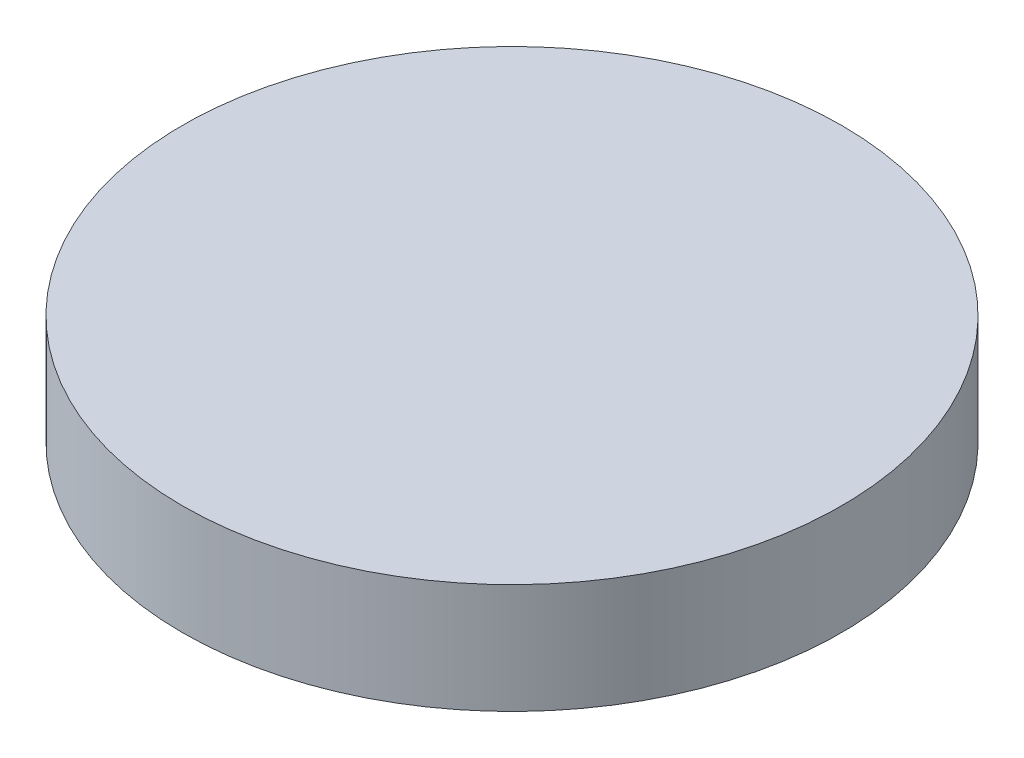
ISO-10303-21;
HEADER;
FILE_DESCRIPTION(('STEP AP214'),'2;1');
FILE_NAME('part.step','',(''),(''),'','','');
FILE_SCHEMA(('AUTOMOTIVE_DESIGN { 1 0 10303 214 1 1 1 1 }'));
ENDSEC;
DATA;
#1=APPLICATION_CONTEXT('core data for automotive mechanical design processes');
#2=APPLICATION_PROTOCOL_DEFINITION('international standard','automotive_design',2000,#1);
#3=PRODUCT_CONTEXT('',#1,'mechanical');
#4=PRODUCT('Part','Part','',(#3));
#5=PRODUCT_RELATED_PRODUCT_CATEGORY('part','',(#4));
#6=PRODUCT_DEFINITION_FORMATION('','',#4);
#7=PRODUCT_DEFINITION_CONTEXT('part definition',#1,'design');
#8=PRODUCT_DEFINITION('design','',#6,#7);
#9=PRODUCT_DEFINITION_SHAPE('','',#8);
#10=(LENGTH_UNIT() NAMED_UNIT(*) SI_UNIT(.MILLI.,.METRE.));
#11=(NAMED_UNIT(*) PLANE_ANGLE_UNIT() SI_UNIT($,.RADIAN.));
#12=(NAMED_UNIT(*) SI_UNIT($,.STERADIAN.) SOLID_ANGLE_UNIT());
#13=UNCERTAINTY_MEASURE_WITH_UNIT(LENGTH_MEASURE(1.E-05),#10,'distance_accuracy_value','');
#14=(GEOMETRIC_REPRESENTATION_CONTEXT(3) GLOBAL_UNCERTAINTY_ASSIGNED_CONTEXT((#13)) GLOBAL_UNIT_ASSIGNED_CONTEXT((#10,
#11,#12)) REPRESENTATION_CONTEXT('',''));
#15=CARTESIAN_POINT('',(0.,0.,0.));
#16=DIRECTION('',(0.,0.,1.));
#17=DIRECTION('',(1.,0.,0.));
#18=AXIS2_PLACEMENT_3D('',#15,#16,#17);
#19=CARTESIAN_POINT('',(0.,25.4,0.));
#20=DIRECTION('',(0.,-1.,0.));
#21=DIRECTION('',(0.,0.,-1.));
#22=AXIS2_PLACEMENT_3D('',#19,#20,#21);
#23=CYLINDRICAL_SURFACE('',#22,76.2);
#24=CARTESIAN_POINT('',(0.,25.4,0.));
#25=DIRECTION('',(0.,1.,0.));
#26=DIRECTION('',(0.,0.,1.));
#27=AXIS2_PLACEMENT_3D('',#24,#25,#26);
#28=CIRCLE('',#27,76.2);
#29=CARTESIAN_POINT('',(0.,25.4,76.2));
#30=VERTEX_POINT('',#29);
#31=EDGE_CURVE('E10',#30,#30,#28,.T.);
#32=ORIENTED_EDGE('',*,*,#31,.F.);
#33=EDGE_LOOP('',(#32));
#34=FACE_BOUND('',#33,.T.);
#35=CARTESIAN_POINT('',(0.,0.,0.));
#36=DIRECTION('',(0.,1.,0.));
#37=DIRECTION('',(0.,0.,1.));
#38=AXIS2_PLACEMENT_3D('',#35,#36,#37);
#39=CIRCLE('',#38,76.2);
#40=CARTESIAN_POINT('',(0.,0.,76.2));
#41=VERTEX_POINT('',#40);
#42=EDGE_CURVE('E36',#41,#41,#39,.T.);
#43=ORIENTED_EDGE('',*,*,#42,.T.);
#44=EDGE_LOOP('',(#43));
#45=FACE_BOUND('',#44,.T.);
#46=ADVANCED_FACE('F33',(#34,#45),#23,.T.);
#47=CARTESIAN_POINT('',(0.,25.4,0.));
#48=DIRECTION('',(0.,1.,0.));
#49=DIRECTION('',(0.,0.,1.));
#50=AXIS2_PLACEMENT_3D('',#47,#48,#49);
#51=PLANE('',#50);
#52=ORIENTED_EDGE('',*,*,#31,.T.);
#53=EDGE_LOOP('',(#52));
#54=FACE_BOUND('',#53,.T.);
#55=ADVANCED_FACE('F48',(#54),#51,.T.);
#56=CARTESIAN_POINT('',(0.,0.,0.));
#57=DIRECTION('',(0.,1.,0.));
#58=DIRECTION('',(0.,0.,1.));
#59=AXIS2_PLACEMENT_3D('',#56,#57,#58);
#60=PLANE('',#59);
#61=ORIENTED_EDGE('',*,*,#42,.F.);
#62=EDGE_LOOP('',(#61));
#63=FACE_BOUND('',#62,.T.);
#64=ADVANCED_FACE('F46',(#63),#60,.F.);
#65=CLOSED_SHELL('',(#46,#55,#64));
#66=MANIFOLD_SOLID_BREP('B2',#65);
#67=ADVANCED_BREP_SHAPE_REPRESENTATION('',(#18,#66),#14);
#68=SHAPE_DEFINITION_REPRESENTATION(#9,#67);
ENDSEC;
END-ISO-10303-21;
